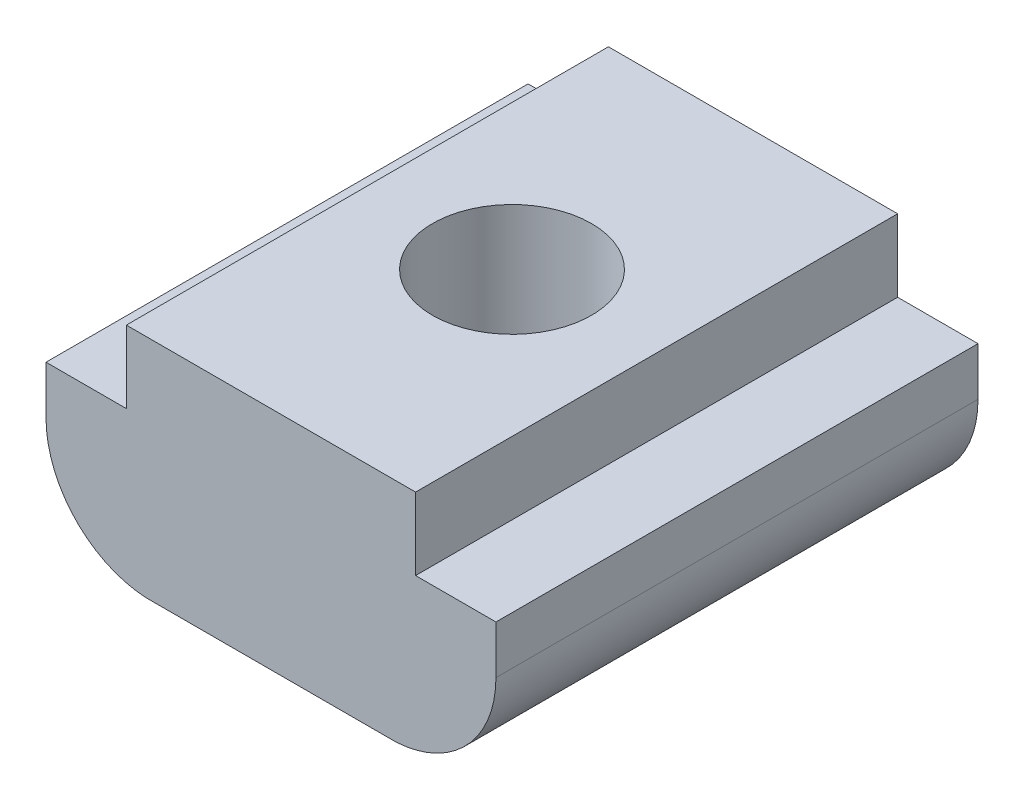
ISO-10303-21;
HEADER;
FILE_DESCRIPTION(('STEP AP214'),'2;1');
FILE_NAME('part.step','',(''),(''),'','','');
FILE_SCHEMA(('AUTOMOTIVE_DESIGN { 1 0 10303 214 1 1 1 1 }'));
ENDSEC;
DATA;
#1=APPLICATION_CONTEXT('core data for automotive mechanical design processes');
#2=APPLICATION_PROTOCOL_DEFINITION('international standard','automotive_design',2000,#1);
#3=PRODUCT_CONTEXT('',#1,'mechanical');
#4=PRODUCT('Part','Part','',(#3));
#5=PRODUCT_RELATED_PRODUCT_CATEGORY('part','',(#4));
#6=PRODUCT_DEFINITION_FORMATION('','',#4);
#7=PRODUCT_DEFINITION_CONTEXT('part definition',#1,'design');
#8=PRODUCT_DEFINITION('design','',#6,#7);
#9=PRODUCT_DEFINITION_SHAPE('','',#8);
#10=(LENGTH_UNIT() NAMED_UNIT(*) SI_UNIT(.MILLI.,.METRE.));
#11=(NAMED_UNIT(*) PLANE_ANGLE_UNIT() SI_UNIT($,.RADIAN.));
#12=(NAMED_UNIT(*) SI_UNIT($,.STERADIAN.) SOLID_ANGLE_UNIT());
#13=UNCERTAINTY_MEASURE_WITH_UNIT(LENGTH_MEASURE(1.E-05),#10,'distance_accuracy_value','');
#14=(GEOMETRIC_REPRESENTATION_CONTEXT(3) GLOBAL_UNCERTAINTY_ASSIGNED_CONTEXT((#13)) GLOBAL_UNIT_ASSIGNED_CONTEXT((#10,
#11,#12)) REPRESENTATION_CONTEXT('',''));
#15=CARTESIAN_POINT('',(0.,0.,0.));
#16=DIRECTION('',(0.,0.,1.));
#17=DIRECTION('',(1.,0.,0.));
#18=AXIS2_PLACEMENT_3D('',#15,#16,#17);
#19=CARTESIAN_POINT('',(2.99999999999999,3.00000000000002,5.));
#20=DIRECTION('',(-1.,0.,0.));
#21=DIRECTION('',(0.,-1.,0.));
#22=AXIS2_PLACEMENT_3D('',#19,#20,#21);
#23=PLANE('',#22);
#24=DIRECTION('',(0.,1.,0.));
#25=VECTOR('',#24,1.);
#26=CARTESIAN_POINT('',(2.99999999999999,3.00000000000002,-5.));
#27=LINE('',#26,#25);
#28=CARTESIAN_POINT('',(3.,1.50000000000002,-5.));
#29=VERTEX_POINT('',#28);
#30=CARTESIAN_POINT('',(2.99999999999999,3.00000000000002,-5.));
#31=VERTEX_POINT('',#30);
#32=EDGE_CURVE('E143',#29,#31,#27,.T.);
#33=ORIENTED_EDGE('',*,*,#32,.T.);
#34=DIRECTION('',(0.,0.,-1.));
#35=VECTOR('',#34,1.);
#36=CARTESIAN_POINT('',(2.99999999999999,3.00000000000002,5.));
#37=LINE('',#36,#35);
#38=CARTESIAN_POINT('',(2.99999999999999,3.00000000000002,5.));
#39=VERTEX_POINT('',#38);
#40=EDGE_CURVE('E11',#39,#31,#37,.T.);
#41=ORIENTED_EDGE('',*,*,#40,.F.);
#42=DIRECTION('',(0.,1.,0.));
#43=VECTOR('',#42,1.);
#44=CARTESIAN_POINT('',(2.99999999999999,3.00000000000002,5.));
#45=LINE('',#44,#43);
#46=CARTESIAN_POINT('',(3.,1.50000000000002,5.));
#47=VERTEX_POINT('',#46);
#48=EDGE_CURVE('E162',#47,#39,#45,.T.);
#49=ORIENTED_EDGE('',*,*,#48,.F.);
#50=DIRECTION('',(0.,0.,-1.));
#51=VECTOR('',#50,1.);
#52=CARTESIAN_POINT('',(3.,1.50000000000002,5.));
#53=LINE('',#52,#51);
#54=EDGE_CURVE('E139',#47,#29,#53,.T.);
#55=ORIENTED_EDGE('',*,*,#54,.T.);
#56=EDGE_LOOP('',(#33,#41,#49,#55));
#57=FACE_BOUND('',#56,.T.);
#58=ADVANCED_FACE('F35',(#57),#23,.F.);
#59=CARTESIAN_POINT('',(2.99999999999999,3.00000000000002,5.));
#60=DIRECTION('',(0.,-1.,0.));
#61=DIRECTION('',(1.,0.,0.));
#62=AXIS2_PLACEMENT_3D('',#59,#60,#61);
#63=PLANE('',#62);
#64=CARTESIAN_POINT('',(0.,3.,0.));
#65=DIRECTION('',(0.,1.,0.));
#66=DIRECTION('',(0.,0.,1.));
#67=AXIS2_PLACEMENT_3D('',#64,#65,#66);
#68=CIRCLE('',#67,1.65);
#69=CARTESIAN_POINT('',(0.,3.,1.65));
#70=VERTEX_POINT('',#69);
#71=EDGE_CURVE('E211',#70,#70,#68,.T.);
#72=ORIENTED_EDGE('',*,*,#71,.F.);
#73=EDGE_LOOP('',(#72));
#74=FACE_BOUND('',#73,.T.);
#75=DIRECTION('',(-1.,0.,0.));
#76=VECTOR('',#75,1.);
#77=CARTESIAN_POINT('',(2.99999999999999,3.00000000000002,-5.));
#78=LINE('',#77,#76);
#79=CARTESIAN_POINT('',(-3.00000000000001,2.99999999999998,-5.));
#80=VERTEX_POINT('',#79);
#81=EDGE_CURVE('E146',#31,#80,#78,.T.);
#82=ORIENTED_EDGE('',*,*,#81,.T.);
#83=DIRECTION('',(0.,0.,-1.));
#84=VECTOR('',#83,1.);
#85=CARTESIAN_POINT('',(-3.00000000000001,2.99999999999998,5.));
#86=LINE('',#85,#84);
#87=CARTESIAN_POINT('',(-3.00000000000001,2.99999999999998,5.));
#88=VERTEX_POINT('',#87);
#89=EDGE_CURVE('E43',#88,#80,#86,.T.);
#90=ORIENTED_EDGE('',*,*,#89,.F.);
#91=DIRECTION('',(-1.,0.,0.));
#92=VECTOR('',#91,1.);
#93=CARTESIAN_POINT('',(2.99999999999999,3.00000000000002,5.));
#94=LINE('',#93,#92);
#95=EDGE_CURVE('E100',#39,#88,#94,.T.);
#96=ORIENTED_EDGE('',*,*,#95,.F.);
#97=ORIENTED_EDGE('',*,*,#40,.T.);
#98=EDGE_LOOP('',(#82,#90,#96,#97));
#99=FACE_BOUND('',#98,.T.);
#100=ADVANCED_FACE('F217',(#74,#99),#63,.F.);
#101=CARTESIAN_POINT('',(-3.00000000000001,2.99999999999998,5.));
#102=DIRECTION('',(1.,0.,0.));
#103=DIRECTION('',(0.,1.,0.));
#104=AXIS2_PLACEMENT_3D('',#101,#102,#103);
#105=PLANE('',#104);
#106=DIRECTION('',(0.,-1.,0.));
#107=VECTOR('',#106,1.);
#108=CARTESIAN_POINT('',(-3.00000000000001,2.99999999999998,-5.));
#109=LINE('',#108,#107);
#110=CARTESIAN_POINT('',(-3.,1.49999999999998,-5.));
#111=VERTEX_POINT('',#110);
#112=EDGE_CURVE('E149',#80,#111,#109,.T.);
#113=ORIENTED_EDGE('',*,*,#112,.T.);
#114=DIRECTION('',(0.,0.,-1.));
#115=VECTOR('',#114,1.);
#116=CARTESIAN_POINT('',(-3.,1.49999999999998,5.));
#117=LINE('',#116,#115);
#118=CARTESIAN_POINT('',(-3.,1.49999999999998,5.));
#119=VERTEX_POINT('',#118);
#120=EDGE_CURVE('E175',#119,#111,#117,.T.);
#121=ORIENTED_EDGE('',*,*,#120,.F.);
#122=DIRECTION('',(0.,-1.,0.));
#123=VECTOR('',#122,1.);
#124=CARTESIAN_POINT('',(-3.00000000000001,2.99999999999998,5.));
#125=LINE('',#124,#123);
#126=EDGE_CURVE('E183',#88,#119,#125,.T.);
#127=ORIENTED_EDGE('',*,*,#126,.F.);
#128=ORIENTED_EDGE('',*,*,#89,.T.);
#129=EDGE_LOOP('',(#113,#121,#127,#128));
#130=FACE_BOUND('',#129,.T.);
#131=ADVANCED_FACE('F181',(#130),#105,.F.);
#132=CARTESIAN_POINT('',(-3.,1.49999999999998,5.));
#133=DIRECTION('',(0.,-1.,0.));
#134=DIRECTION('',(1.,0.,0.));
#135=AXIS2_PLACEMENT_3D('',#132,#133,#134);
#136=PLANE('',#135);
#137=DIRECTION('',(-1.,0.,0.));
#138=VECTOR('',#137,1.);
#139=CARTESIAN_POINT('',(-3.,1.49999999999998,-5.));
#140=LINE('',#139,#138);
#141=CARTESIAN_POINT('',(-4.6667467312933,1.49999999999997,-5.));
#142=VERTEX_POINT('',#141);
#143=EDGE_CURVE('E151',#111,#142,#140,.T.);
#144=ORIENTED_EDGE('',*,*,#143,.T.);
#145=DIRECTION('',(0.,0.,-1.));
#146=VECTOR('',#145,1.);
#147=CARTESIAN_POINT('',(-4.6667467312933,1.49999999999997,5.));
#148=LINE('',#147,#146);
#149=CARTESIAN_POINT('',(-4.6667467312933,1.49999999999997,5.));
#150=VERTEX_POINT('',#149);
#151=EDGE_CURVE('E172',#150,#142,#148,.T.);
#152=ORIENTED_EDGE('',*,*,#151,.F.);
#153=DIRECTION('',(-1.,0.,0.));
#154=VECTOR('',#153,1.);
#155=CARTESIAN_POINT('',(-3.,1.49999999999998,5.));
#156=LINE('',#155,#154);
#157=EDGE_CURVE('E201',#119,#150,#156,.T.);
#158=ORIENTED_EDGE('',*,*,#157,.F.);
#159=ORIENTED_EDGE('',*,*,#120,.T.);
#160=EDGE_LOOP('',(#144,#152,#158,#159));
#161=FACE_BOUND('',#160,.T.);
#162=ADVANCED_FACE('F192',(#161),#136,.F.);
#163=CARTESIAN_POINT('',(-4.6667467312933,1.49999999999997,5.));
#164=DIRECTION('',(1.,0.,0.));
#165=DIRECTION('',(0.,1.,0.));
#166=AXIS2_PLACEMENT_3D('',#163,#164,#165);
#167=PLANE('',#166);
#168=DIRECTION('',(0.,-1.,0.));
#169=VECTOR('',#168,1.);
#170=CARTESIAN_POINT('',(-4.6667467312933,1.49999999999997,-5.));
#171=LINE('',#170,#169);
#172=CARTESIAN_POINT('',(-4.66674673129329,0.499999999999967,-5.));
#173=VERTEX_POINT('',#172);
#174=EDGE_CURVE('E153',#142,#173,#171,.T.);
#175=ORIENTED_EDGE('',*,*,#174,.T.);
#176=DIRECTION('',(0.,0.,-1.));
#177=VECTOR('',#176,1.);
#178=CARTESIAN_POINT('',(-4.66674673129329,0.499999999999967,5.));
#179=LINE('',#178,#177);
#180=CARTESIAN_POINT('',(-4.66674673129329,0.499999999999967,5.));
#181=VERTEX_POINT('',#180);
#182=EDGE_CURVE('E169',#181,#173,#179,.T.);
#183=ORIENTED_EDGE('',*,*,#182,.F.);
#184=DIRECTION('',(0.,-1.,0.));
#185=VECTOR('',#184,1.);
#186=CARTESIAN_POINT('',(-4.6667467312933,1.49999999999997,5.));
#187=LINE('',#186,#185);
#188=EDGE_CURVE('E198',#150,#181,#187,.T.);
#189=ORIENTED_EDGE('',*,*,#188,.F.);
#190=ORIENTED_EDGE('',*,*,#151,.T.);
#191=EDGE_LOOP('',(#175,#183,#189,#190));
#192=FACE_BOUND('',#191,.T.);
#193=ADVANCED_FACE('F196',(#192),#167,.F.);
#194=CARTESIAN_POINT('',(-2.46907071737372,0.499999999999982,5.));
#195=DIRECTION('',(0.,0.,-1.));
#196=DIRECTION('',(-1.,0.,0.));
#197=AXIS2_PLACEMENT_3D('',#194,#195,#196);
#198=CYLINDRICAL_SURFACE('',#197,2.19767601391957);
#199=CARTESIAN_POINT('',(-2.46907071737372,0.499999999999982,-5.));
#200=DIRECTION('',(0.,0.,1.));
#201=DIRECTION('',(1.,0.,0.));
#202=AXIS2_PLACEMENT_3D('',#199,#200,#201);
#203=CIRCLE('',#202,2.19767601391957);
#204=CARTESIAN_POINT('',(-2.60000000000001,-1.69377240959687,-5.));
#205=VERTEX_POINT('',#204);
#206=EDGE_CURVE('E155',#173,#205,#203,.T.);
#207=ORIENTED_EDGE('',*,*,#206,.T.);
#208=DIRECTION('',(0.,0.,-1.));
#209=VECTOR('',#208,1.);
#210=CARTESIAN_POINT('',(-2.60000000000001,-1.69377240959687,5.));
#211=LINE('',#210,#209);
#212=CARTESIAN_POINT('',(-2.60000000000001,-1.69377240959687,5.));
#213=VERTEX_POINT('',#212);
#214=EDGE_CURVE('E166',#213,#205,#211,.T.);
#215=ORIENTED_EDGE('',*,*,#214,.F.);
#216=CARTESIAN_POINT('',(-2.46907071737372,0.499999999999982,5.));
#217=DIRECTION('',(0.,0.,1.));
#218=DIRECTION('',(1.,0.,0.));
#219=AXIS2_PLACEMENT_3D('',#216,#217,#218);
#220=CIRCLE('',#219,2.19767601391957);
#221=EDGE_CURVE('E200',#181,#213,#220,.T.);
#222=ORIENTED_EDGE('',*,*,#221,.F.);
#223=ORIENTED_EDGE('',*,*,#182,.T.);
#224=EDGE_LOOP('',(#207,#215,#222,#223));
#225=FACE_BOUND('',#224,.T.);
#226=ADVANCED_FACE('F227',(#225),#198,.T.);
#227=CARTESIAN_POINT('',(2.60000000000006,-1.69377240959683,5.));
#228=DIRECTION('',(0.,1.,0.));
#229=DIRECTION('',(-1.,0.,0.));
#230=AXIS2_PLACEMENT_3D('',#227,#228,#229);
#231=PLANE('',#230);
#232=CARTESIAN_POINT('',(0.,-1.6937724095969,0.));
#233=DIRECTION('',(0.,1.,0.));
#234=DIRECTION('',(0.,0.,1.));
#235=AXIS2_PLACEMENT_3D('',#232,#233,#234);
#236=CIRCLE('',#235,1.65);
#237=CARTESIAN_POINT('',(0.,-1.6937724095969,1.65));
#238=VERTEX_POINT('',#237);
#239=EDGE_CURVE('E147',#238,#238,#236,.T.);
#240=ORIENTED_EDGE('',*,*,#239,.T.);
#241=EDGE_LOOP('',(#240));
#242=FACE_BOUND('',#241,.T.);
#243=DIRECTION('',(1.,0.,0.));
#244=VECTOR('',#243,1.);
#245=CARTESIAN_POINT('',(2.60000000000006,-1.69377240959683,-5.));
#246=LINE('',#245,#244);
#247=CARTESIAN_POINT('',(2.60000000000006,-1.69377240959683,-5.));
#248=VERTEX_POINT('',#247);
#249=EDGE_CURVE('E157',#205,#248,#246,.T.);
#250=ORIENTED_EDGE('',*,*,#249,.T.);
#251=DIRECTION('',(0.,0.,-1.));
#252=VECTOR('',#251,1.);
#253=CARTESIAN_POINT('',(2.60000000000006,-1.69377240959683,5.));
#254=LINE('',#253,#252);
#255=CARTESIAN_POINT('',(2.60000000000006,-1.69377240959683,5.));
#256=VERTEX_POINT('',#255);
#257=EDGE_CURVE('E134',#256,#248,#254,.T.);
#258=ORIENTED_EDGE('',*,*,#257,.F.);
#259=DIRECTION('',(1.,0.,0.));
#260=VECTOR('',#259,1.);
#261=CARTESIAN_POINT('',(2.60000000000006,-1.69377240959683,5.));
#262=LINE('',#261,#260);
#263=EDGE_CURVE('E125',#213,#256,#262,.T.);
#264=ORIENTED_EDGE('',*,*,#263,.F.);
#265=ORIENTED_EDGE('',*,*,#214,.T.);
#266=EDGE_LOOP('',(#250,#258,#264,#265));
#267=FACE_BOUND('',#266,.T.);
#268=ADVANCED_FACE('F224',(#242,#267),#231,.F.);
#269=CARTESIAN_POINT('',(2.46907071737373,0.500000000000017,5.));
#270=DIRECTION('',(0.,0.,-1.));
#271=DIRECTION('',(-1.,0.,0.));
#272=AXIS2_PLACEMENT_3D('',#269,#270,#271);
#273=CYLINDRICAL_SURFACE('',#272,2.19767601391957);
#274=CARTESIAN_POINT('',(2.46907071737373,0.500000000000017,-5.));
#275=DIRECTION('',(0.,0.,1.));
#276=DIRECTION('',(-1.,0.,0.));
#277=AXIS2_PLACEMENT_3D('',#274,#275,#276);
#278=CIRCLE('',#277,2.19767601391957);
#279=CARTESIAN_POINT('',(4.6667467312933,0.500000000000033,-5.));
#280=VERTEX_POINT('',#279);
#281=EDGE_CURVE('E133',#248,#280,#278,.T.);
#282=ORIENTED_EDGE('',*,*,#281,.T.);
#283=DIRECTION('',(0.,0.,-1.));
#284=VECTOR('',#283,1.);
#285=CARTESIAN_POINT('',(4.6667467312933,0.500000000000033,5.));
#286=LINE('',#285,#284);
#287=CARTESIAN_POINT('',(4.6667467312933,0.500000000000033,5.));
#288=VERTEX_POINT('',#287);
#289=EDGE_CURVE('E130',#288,#280,#286,.T.);
#290=ORIENTED_EDGE('',*,*,#289,.F.);
#291=CARTESIAN_POINT('',(2.46907071737373,0.500000000000017,5.));
#292=DIRECTION('',(0.,0.,1.));
#293=DIRECTION('',(-1.,0.,0.));
#294=AXIS2_PLACEMENT_3D('',#291,#292,#293);
#295=CIRCLE('',#294,2.19767601391957);
#296=EDGE_CURVE('E119',#256,#288,#295,.T.);
#297=ORIENTED_EDGE('',*,*,#296,.F.);
#298=ORIENTED_EDGE('',*,*,#257,.T.);
#299=EDGE_LOOP('',(#282,#290,#297,#298));
#300=FACE_BOUND('',#299,.T.);
#301=ADVANCED_FACE('F131',(#300),#273,.T.);
#302=CARTESIAN_POINT('',(4.6667467312933,1.50000000000003,5.));
#303=DIRECTION('',(-1.,0.,0.));
#304=DIRECTION('',(0.,-1.,0.));
#305=AXIS2_PLACEMENT_3D('',#302,#303,#304);
#306=PLANE('',#305);
#307=DIRECTION('',(0.,1.,0.));
#308=VECTOR('',#307,1.);
#309=CARTESIAN_POINT('',(4.6667467312933,1.50000000000003,-5.));
#310=LINE('',#309,#308);
#311=CARTESIAN_POINT('',(4.6667467312933,1.50000000000003,-5.));
#312=VERTEX_POINT('',#311);
#313=EDGE_CURVE('E86',#280,#312,#310,.T.);
#314=ORIENTED_EDGE('',*,*,#313,.T.);
#315=DIRECTION('',(0.,0.,-1.));
#316=VECTOR('',#315,1.);
#317=CARTESIAN_POINT('',(4.6667467312933,1.50000000000003,5.));
#318=LINE('',#317,#316);
#319=CARTESIAN_POINT('',(4.6667467312933,1.50000000000003,5.));
#320=VERTEX_POINT('',#319);
#321=EDGE_CURVE('E135',#320,#312,#318,.T.);
#322=ORIENTED_EDGE('',*,*,#321,.F.);
#323=DIRECTION('',(0.,1.,0.));
#324=VECTOR('',#323,1.);
#325=CARTESIAN_POINT('',(4.6667467312933,1.50000000000003,5.));
#326=LINE('',#325,#324);
#327=EDGE_CURVE('E123',#288,#320,#326,.T.);
#328=ORIENTED_EDGE('',*,*,#327,.F.);
#329=ORIENTED_EDGE('',*,*,#289,.T.);
#330=EDGE_LOOP('',(#314,#322,#328,#329));
#331=FACE_BOUND('',#330,.T.);
#332=ADVANCED_FACE('F137',(#331),#306,.F.);
#333=CARTESIAN_POINT('',(3.,1.50000000000002,5.));
#334=DIRECTION('',(0.,-1.,0.));
#335=DIRECTION('',(1.,0.,0.));
#336=AXIS2_PLACEMENT_3D('',#333,#334,#335);
#337=PLANE('',#336);
#338=DIRECTION('',(-1.,0.,0.));
#339=VECTOR('',#338,1.);
#340=CARTESIAN_POINT('',(3.,1.50000000000002,-5.));
#341=LINE('',#340,#339);
#342=EDGE_CURVE('E92',#312,#29,#341,.T.);
#343=ORIENTED_EDGE('',*,*,#342,.T.);
#344=ORIENTED_EDGE('',*,*,#54,.F.);
#345=DIRECTION('',(-1.,0.,0.));
#346=VECTOR('',#345,1.);
#347=CARTESIAN_POINT('',(3.,1.50000000000002,5.));
#348=LINE('',#347,#346);
#349=EDGE_CURVE('E51',#320,#47,#348,.T.);
#350=ORIENTED_EDGE('',*,*,#349,.F.);
#351=ORIENTED_EDGE('',*,*,#321,.T.);
#352=EDGE_LOOP('',(#343,#344,#350,#351));
#353=FACE_BOUND('',#352,.T.);
#354=ADVANCED_FACE('F287',(#353),#337,.F.);
#355=CARTESIAN_POINT('',(2.46907071737373,0.500000000000017,5.));
#356=DIRECTION('',(0.,0.,-1.));
#357=DIRECTION('',(-1.,0.,0.));
#358=AXIS2_PLACEMENT_3D('',#355,#356,#357);
#359=PLANE('',#358);
#360=ORIENTED_EDGE('',*,*,#48,.T.);
#361=ORIENTED_EDGE('',*,*,#95,.T.);
#362=ORIENTED_EDGE('',*,*,#126,.T.);
#363=ORIENTED_EDGE('',*,*,#157,.T.);
#364=ORIENTED_EDGE('',*,*,#188,.T.);
#365=ORIENTED_EDGE('',*,*,#221,.T.);
#366=ORIENTED_EDGE('',*,*,#263,.T.);
#367=ORIENTED_EDGE('',*,*,#296,.T.);
#368=ORIENTED_EDGE('',*,*,#327,.T.);
#369=ORIENTED_EDGE('',*,*,#349,.T.);
#370=EDGE_LOOP('',(#360,#361,#362,#363,#364,#365,#366,#367,#368,#369));
#371=FACE_BOUND('',#370,.T.);
#372=ADVANCED_FACE('F121',(#371),#359,.F.);
#373=CARTESIAN_POINT('',(2.46907071737373,0.500000000000017,-5.));
#374=DIRECTION('',(0.,0.,-1.));
#375=DIRECTION('',(-1.,0.,0.));
#376=AXIS2_PLACEMENT_3D('',#373,#374,#375);
#377=PLANE('',#376);
#378=ORIENTED_EDGE('',*,*,#32,.F.);
#379=ORIENTED_EDGE('',*,*,#342,.F.);
#380=ORIENTED_EDGE('',*,*,#313,.F.);
#381=ORIENTED_EDGE('',*,*,#281,.F.);
#382=ORIENTED_EDGE('',*,*,#249,.F.);
#383=ORIENTED_EDGE('',*,*,#206,.F.);
#384=ORIENTED_EDGE('',*,*,#174,.F.);
#385=ORIENTED_EDGE('',*,*,#143,.F.);
#386=ORIENTED_EDGE('',*,*,#112,.F.);
#387=ORIENTED_EDGE('',*,*,#81,.F.);
#388=EDGE_LOOP('',(#378,#379,#380,#381,#382,#383,#384,#385,#386,#387));
#389=FACE_BOUND('',#388,.T.);
#390=ADVANCED_FACE('F187',(#389),#377,.T.);
#391=CARTESIAN_POINT('',(0.,3.,0.));
#392=DIRECTION('',(0.,1.,0.));
#393=DIRECTION('',(0.,0.,1.));
#394=AXIS2_PLACEMENT_3D('',#391,#392,#393);
#395=CYLINDRICAL_SURFACE('',#394,1.65);
#396=ORIENTED_EDGE('',*,*,#239,.F.);
#397=EDGE_LOOP('',(#396));
#398=FACE_BOUND('',#397,.T.);
#399=ORIENTED_EDGE('',*,*,#71,.T.);
#400=EDGE_LOOP('',(#399));
#401=FACE_BOUND('',#400,.T.);
#402=ADVANCED_FACE('F215',(#398,#401),#395,.F.);
#403=CLOSED_SHELL('',(#58,#100,#131,#162,#193,#226,#268,#301,#332,#354,#372,#390,#402));
#404=MANIFOLD_SOLID_BREP('B2',#403);
#405=ADVANCED_BREP_SHAPE_REPRESENTATION('',(#18,#404),#14);
#406=SHAPE_DEFINITION_REPRESENTATION(#9,#405);
ENDSEC;
END-ISO-10303-21;
